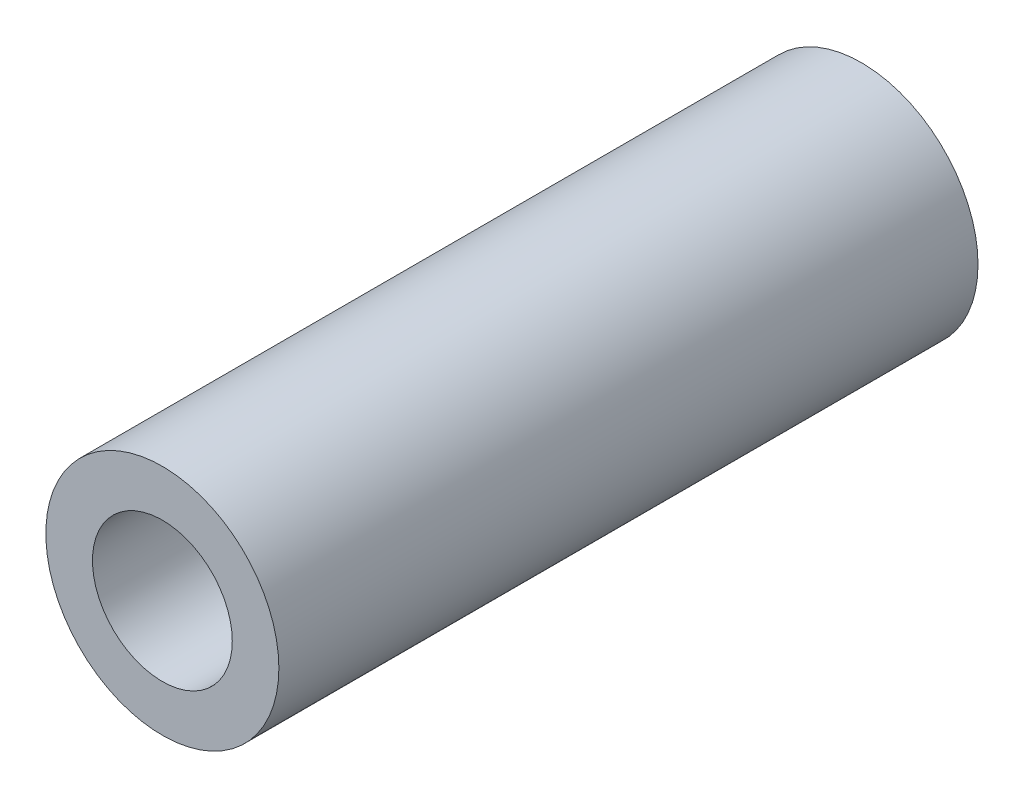
ISO-10303-21;
HEADER;
FILE_DESCRIPTION(('STEP AP214'),'2;1');
FILE_NAME('part.step','',(''),(''),'','','');
FILE_SCHEMA(('AUTOMOTIVE_DESIGN { 1 0 10303 214 1 1 1 1 }'));
ENDSEC;
DATA;
#1=APPLICATION_CONTEXT('core data for automotive mechanical design processes');
#2=APPLICATION_PROTOCOL_DEFINITION('international standard','automotive_design',2000,#1);
#3=PRODUCT_CONTEXT('',#1,'mechanical');
#4=PRODUCT('Part','Part','',(#3));
#5=PRODUCT_RELATED_PRODUCT_CATEGORY('part','',(#4));
#6=PRODUCT_DEFINITION_FORMATION('','',#4);
#7=PRODUCT_DEFINITION_CONTEXT('part definition',#1,'design');
#8=PRODUCT_DEFINITION('design','',#6,#7);
#9=PRODUCT_DEFINITION_SHAPE('','',#8);
#10=(LENGTH_UNIT() NAMED_UNIT(*) SI_UNIT(.MILLI.,.METRE.));
#11=(NAMED_UNIT(*) PLANE_ANGLE_UNIT() SI_UNIT($,.RADIAN.));
#12=(NAMED_UNIT(*) SI_UNIT($,.STERADIAN.) SOLID_ANGLE_UNIT());
#13=UNCERTAINTY_MEASURE_WITH_UNIT(LENGTH_MEASURE(1.E-05),#10,'distance_accuracy_value','');
#14=(GEOMETRIC_REPRESENTATION_CONTEXT(3) GLOBAL_UNCERTAINTY_ASSIGNED_CONTEXT((#13)) GLOBAL_UNIT_ASSIGNED_CONTEXT((#10,
#11,#12)) REPRESENTATION_CONTEXT('',''));
#15=CARTESIAN_POINT('',(0.,0.,0.));
#16=DIRECTION('',(0.,0.,1.));
#17=DIRECTION('',(1.,0.,0.));
#18=AXIS2_PLACEMENT_3D('',#15,#16,#17);
#19=CARTESIAN_POINT('',(0.,0.,7.5));
#20=DIRECTION('',(0.,0.,1.));
#21=DIRECTION('',(1.,0.,0.));
#22=AXIS2_PLACEMENT_3D('',#19,#20,#21);
#23=PLANE('',#22);
#24=CARTESIAN_POINT('',(0.,0.,7.5));
#25=DIRECTION('',(0.,0.,1.));
#26=DIRECTION('',(1.,0.,0.));
#27=AXIS2_PLACEMENT_3D('',#24,#25,#26);
#28=CIRCLE('',#27,2.5);
#29=CARTESIAN_POINT('',(2.5,0.,7.5));
#30=VERTEX_POINT('',#29);
#31=EDGE_CURVE('E10',#30,#30,#28,.T.);
#32=ORIENTED_EDGE('',*,*,#31,.T.);
#33=EDGE_LOOP('',(#32));
#34=FACE_BOUND('',#33,.T.);
#35=CARTESIAN_POINT('',(0.,0.,7.5));
#36=DIRECTION('',(0.,0.,1.));
#37=DIRECTION('',(1.,0.,0.));
#38=AXIS2_PLACEMENT_3D('',#35,#36,#37);
#39=CIRCLE('',#38,1.5);
#40=CARTESIAN_POINT('',(1.5,0.,7.5));
#41=VERTEX_POINT('',#40);
#42=EDGE_CURVE('E39',#41,#41,#39,.T.);
#43=ORIENTED_EDGE('',*,*,#42,.F.);
#44=EDGE_LOOP('',(#43));
#45=FACE_BOUND('',#44,.T.);
#46=ADVANCED_FACE('F28',(#34,#45),#23,.T.);
#47=CARTESIAN_POINT('',(0.,0.,-7.5));
#48=DIRECTION('',(0.,0.,1.));
#49=DIRECTION('',(1.,0.,0.));
#50=AXIS2_PLACEMENT_3D('',#47,#48,#49);
#51=PLANE('',#50);
#52=CARTESIAN_POINT('',(0.,0.,-7.5));
#53=DIRECTION('',(0.,0.,1.));
#54=DIRECTION('',(1.,0.,0.));
#55=AXIS2_PLACEMENT_3D('',#52,#53,#54);
#56=CIRCLE('',#55,2.5);
#57=CARTESIAN_POINT('',(2.5,0.,-7.5));
#58=VERTEX_POINT('',#57);
#59=EDGE_CURVE('E32',#58,#58,#56,.T.);
#60=ORIENTED_EDGE('',*,*,#59,.F.);
#61=EDGE_LOOP('',(#60));
#62=FACE_BOUND('',#61,.T.);
#63=CARTESIAN_POINT('',(0.,0.,-7.5));
#64=DIRECTION('',(0.,0.,1.));
#65=DIRECTION('',(1.,0.,0.));
#66=AXIS2_PLACEMENT_3D('',#63,#64,#65);
#67=CIRCLE('',#66,1.5);
#68=CARTESIAN_POINT('',(1.5,0.,-7.5));
#69=VERTEX_POINT('',#68);
#70=EDGE_CURVE('E41',#69,#69,#67,.T.);
#71=ORIENTED_EDGE('',*,*,#70,.T.);
#72=EDGE_LOOP('',(#71));
#73=FACE_BOUND('',#72,.T.);
#74=ADVANCED_FACE('F51',(#62,#73),#51,.F.);
#75=CARTESIAN_POINT('',(0.,0.,7.5));
#76=DIRECTION('',(0.,0.,-1.));
#77=DIRECTION('',(-1.,0.,0.));
#78=AXIS2_PLACEMENT_3D('',#75,#76,#77);
#79=CYLINDRICAL_SURFACE('',#78,2.5);
#80=ORIENTED_EDGE('',*,*,#31,.F.);
#81=EDGE_LOOP('',(#80));
#82=FACE_BOUND('',#81,.T.);
#83=ORIENTED_EDGE('',*,*,#59,.T.);
#84=EDGE_LOOP('',(#83));
#85=FACE_BOUND('',#84,.T.);
#86=ADVANCED_FACE('F30',(#82,#85),#79,.T.);
#87=CARTESIAN_POINT('',(0.,0.,7.5));
#88=DIRECTION('',(0.,0.,-1.));
#89=DIRECTION('',(-1.,0.,0.));
#90=AXIS2_PLACEMENT_3D('',#87,#88,#89);
#91=CYLINDRICAL_SURFACE('',#90,1.5);
#92=ORIENTED_EDGE('',*,*,#42,.T.);
#93=EDGE_LOOP('',(#92));
#94=FACE_BOUND('',#93,.T.);
#95=ORIENTED_EDGE('',*,*,#70,.F.);
#96=EDGE_LOOP('',(#95));
#97=FACE_BOUND('',#96,.T.);
#98=ADVANCED_FACE('F47',(#94,#97),#91,.F.);
#99=CLOSED_SHELL('',(#46,#74,#86,#98));
#100=MANIFOLD_SOLID_BREP('B2',#99);
#101=ADVANCED_BREP_SHAPE_REPRESENTATION('',(#18,#100),#14);
#102=SHAPE_DEFINITION_REPRESENTATION(#9,#101);
ENDSEC;
END-ISO-10303-21;
